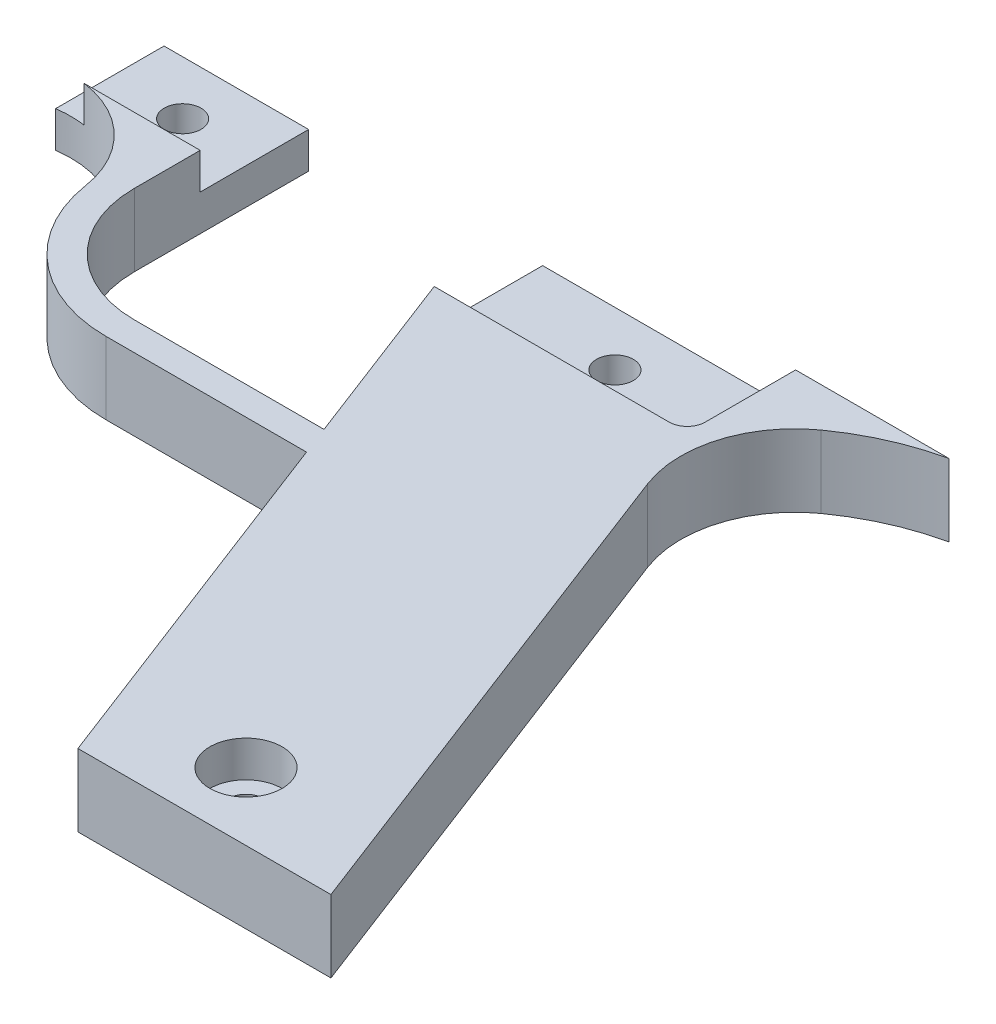
ISO-10303-21;
HEADER;
FILE_DESCRIPTION(('STEP AP214'),'2;1');
FILE_NAME('part.step','',(''),(''),'','','');
FILE_SCHEMA(('AUTOMOTIVE_DESIGN { 1 0 10303 214 1 1 1 1 }'));
ENDSEC;
DATA;
#1=APPLICATION_CONTEXT('core data for automotive mechanical design processes');
#2=APPLICATION_PROTOCOL_DEFINITION('international standard','automotive_design',2000,#1);
#3=PRODUCT_CONTEXT('',#1,'mechanical');
#4=PRODUCT('Part','Part','',(#3));
#5=PRODUCT_RELATED_PRODUCT_CATEGORY('part','',(#4));
#6=PRODUCT_DEFINITION_FORMATION('','',#4);
#7=PRODUCT_DEFINITION_CONTEXT('part definition',#1,'design');
#8=PRODUCT_DEFINITION('design','',#6,#7);
#9=PRODUCT_DEFINITION_SHAPE('','',#8);
#10=(LENGTH_UNIT() NAMED_UNIT(*) SI_UNIT(.MILLI.,.METRE.));
#11=(NAMED_UNIT(*) PLANE_ANGLE_UNIT() SI_UNIT($,.RADIAN.));
#12=(NAMED_UNIT(*) SI_UNIT($,.STERADIAN.) SOLID_ANGLE_UNIT());
#13=UNCERTAINTY_MEASURE_WITH_UNIT(LENGTH_MEASURE(1.E-05),#10,'distance_accuracy_value','');
#14=(GEOMETRIC_REPRESENTATION_CONTEXT(3) GLOBAL_UNCERTAINTY_ASSIGNED_CONTEXT((#13)) GLOBAL_UNIT_ASSIGNED_CONTEXT((#10,
#11,#12)) REPRESENTATION_CONTEXT('',''));
#15=CARTESIAN_POINT('',(0.,0.,0.));
#16=DIRECTION('',(0.,0.,1.));
#17=DIRECTION('',(1.,0.,0.));
#18=AXIS2_PLACEMENT_3D('',#15,#16,#17);
#19=CARTESIAN_POINT('',(-80.2755859595979,12.7,-120.806499719987));
#20=DIRECTION('',(0.,0.,1.));
#21=DIRECTION('',(1.,0.,0.));
#22=AXIS2_PLACEMENT_3D('',#19,#20,#21);
#23=PLANE('',#22);
#24=DIRECTION('',(-1.,0.,0.));
#25=VECTOR('',#24,1.);
#26=CARTESIAN_POINT('',(-80.2755859595979,6.35,-120.806499719987));
#27=LINE('',#26,#25);
#28=CARTESIAN_POINT('',(-80.2755859595979,6.35,-120.806499719987));
#29=VERTEX_POINT('',#28);
#30=CARTESIAN_POINT('',(-105.675585959598,6.35,-120.806499719987));
#31=VERTEX_POINT('',#30);
#32=EDGE_CURVE('E187',#29,#31,#27,.T.);
#33=ORIENTED_EDGE('',*,*,#32,.F.);
#34=DIRECTION('',(0.,-1.,0.));
#35=VECTOR('',#34,1.);
#36=CARTESIAN_POINT('',(-80.2755859595979,12.7,-120.806499719987));
#37=LINE('',#36,#35);
#38=CARTESIAN_POINT('',(-80.2755859595979,0.,-120.806499719987));
#39=VERTEX_POINT('',#38);
#40=EDGE_CURVE('E209',#29,#39,#37,.T.);
#41=ORIENTED_EDGE('',*,*,#40,.T.);
#42=DIRECTION('',(-1.,0.,0.));
#43=VECTOR('',#42,1.);
#44=CARTESIAN_POINT('',(-80.2755859595979,0.,-120.806499719987));
#45=LINE('',#44,#43);
#46=CARTESIAN_POINT('',(-105.675585959598,0.,-120.806499719987));
#47=VERTEX_POINT('',#46);
#48=EDGE_CURVE('E393',#39,#47,#45,.T.);
#49=ORIENTED_EDGE('',*,*,#48,.T.);
#50=DIRECTION('',(0.,-1.,0.));
#51=VECTOR('',#50,1.);
#52=CARTESIAN_POINT('',(-105.675585959598,12.7,-120.806499719987));
#53=LINE('',#52,#51);
#54=EDGE_CURVE('E206',#31,#47,#53,.T.);
#55=ORIENTED_EDGE('',*,*,#54,.F.);
#56=EDGE_LOOP('',(#33,#41,#49,#55));
#57=FACE_BOUND('',#56,.T.);
#58=ADVANCED_FACE('F33',(#57),#23,.F.);
#59=CARTESIAN_POINT('',(-105.675585959598,12.7,-120.806499719987));
#60=DIRECTION('',(1.,0.,0.));
#61=DIRECTION('',(0.,0.,-1.));
#62=AXIS2_PLACEMENT_3D('',#59,#60,#61);
#63=PLANE('',#62);
#64=DIRECTION('',(0.,0.,1.));
#65=VECTOR('',#64,1.);
#66=CARTESIAN_POINT('',(-105.675585959598,6.35,-120.806499719987));
#67=LINE('',#66,#65);
#68=CARTESIAN_POINT('',(-105.675585959598,6.35,-101.756499719987));
#69=VERTEX_POINT('',#68);
#70=EDGE_CURVE('E182',#31,#69,#67,.T.);
#71=ORIENTED_EDGE('',*,*,#70,.F.);
#72=ORIENTED_EDGE('',*,*,#54,.T.);
#73=DIRECTION('',(0.,0.,1.));
#74=VECTOR('',#73,1.);
#75=CARTESIAN_POINT('',(-105.675585959598,0.,-120.806499719987));
#76=LINE('',#75,#74);
#77=CARTESIAN_POINT('',(-105.675585959598,0.,-101.756499719987));
#78=VERTEX_POINT('',#77);
#79=EDGE_CURVE('E204',#47,#78,#76,.T.);
#80=ORIENTED_EDGE('',*,*,#79,.T.);
#81=DIRECTION('',(0.,-1.,0.));
#82=VECTOR('',#81,1.);
#83=CARTESIAN_POINT('',(-105.675585959598,12.7,-101.756499719987));
#84=LINE('',#83,#82);
#85=EDGE_CURVE('E198',#69,#78,#84,.T.);
#86=ORIENTED_EDGE('',*,*,#85,.F.);
#87=EDGE_LOOP('',(#71,#72,#80,#86));
#88=FACE_BOUND('',#87,.T.);
#89=ADVANCED_FACE('F202',(#88),#63,.F.);
#90=CARTESIAN_POINT('',(-92.975585959598,12.7,-111.366660829595));
#91=DIRECTION('',(0.,-1.,0.));
#92=DIRECTION('',(0.,0.,-1.));
#93=AXIS2_PLACEMENT_3D('',#90,#91,#92);
#94=CYLINDRICAL_SURFACE('',#93,3.2385);
#95=CARTESIAN_POINT('',(-92.975585959598,0.,-111.366660829595));
#96=DIRECTION('',(0.,1.,0.));
#97=DIRECTION('',(0.,0.,1.));
#98=AXIS2_PLACEMENT_3D('',#95,#96,#97);
#99=CIRCLE('',#98,3.2385);
#100=CARTESIAN_POINT('',(-92.975585959598,0.,-108.128160829595));
#101=VERTEX_POINT('',#100);
#102=EDGE_CURVE('E396',#101,#101,#99,.T.);
#103=ORIENTED_EDGE('',*,*,#102,.F.);
#104=EDGE_LOOP('',(#103));
#105=FACE_BOUND('',#104,.T.);
#106=CARTESIAN_POINT('',(-92.975585959598,6.35,-111.366660829595));
#107=DIRECTION('',(0.,1.,0.));
#108=DIRECTION('',(0.,0.,1.));
#109=AXIS2_PLACEMENT_3D('',#106,#107,#108);
#110=CIRCLE('',#109,3.2385);
#111=CARTESIAN_POINT('',(-92.975585959598,6.35,-108.128160829595));
#112=VERTEX_POINT('',#111);
#113=EDGE_CURVE('E37',#112,#112,#110,.T.);
#114=ORIENTED_EDGE('',*,*,#113,.T.);
#115=EDGE_LOOP('',(#114));
#116=FACE_BOUND('',#115,.T.);
#117=ADVANCED_FACE('F470',(#105,#116),#94,.F.);
#118=CARTESIAN_POINT('',(0.,12.7,0.));
#119=DIRECTION('',(0.933580426497203,0.,-0.358367949545298));
#120=DIRECTION('',(-0.358367949545298,0.,-0.933580426497203));
#121=AXIS2_PLACEMENT_3D('',#118,#119,#120);
#122=PLANE('',#121);
#123=DIRECTION('',(0.,-1.,0.));
#124=VECTOR('',#123,1.);
#125=CARTESIAN_POINT('',(-26.9383580355441,12.7,-70.1768219392029));
#126=LINE('',#125,#124);
#127=CARTESIAN_POINT('',(-26.9383580355441,12.7,-70.1768219392029));
#128=VERTEX_POINT('',#127);
#129=CARTESIAN_POINT('',(-26.9383580355441,0.,-70.1768219392029));
#130=VERTEX_POINT('',#129);
#131=EDGE_CURVE('E366',#128,#130,#126,.T.);
#132=ORIENTED_EDGE('',*,*,#131,.F.);
#133=DIRECTION('',(0.358367949545298,0.,0.933580426497203));
#134=VECTOR('',#133,1.);
#135=CARTESIAN_POINT('',(0.,12.7,0.));
#136=LINE('',#135,#134);
#137=CARTESIAN_POINT('',(-39.0005859595979,12.7,-101.6));
#138=VERTEX_POINT('',#137);
#139=EDGE_CURVE('E282',#138,#128,#136,.T.);
#140=ORIENTED_EDGE('',*,*,#139,.F.);
#141=DIRECTION('',(0.,-1.,0.));
#142=VECTOR('',#141,1.);
#143=CARTESIAN_POINT('',(-39.0005859595979,12.7,-101.6));
#144=LINE('',#143,#142);
#145=CARTESIAN_POINT('',(-39.0005859595979,6.35,-101.6));
#146=VERTEX_POINT('',#145);
#147=EDGE_CURVE('E298',#138,#146,#144,.T.);
#148=ORIENTED_EDGE('',*,*,#147,.T.);
#149=CARTESIAN_POINT('',(-39.0005859595979,0.,-101.6));
#150=VERTEX_POINT('',#149);
#151=EDGE_CURVE('E297',#146,#150,#144,.T.);
#152=ORIENTED_EDGE('',*,*,#151,.T.);
#153=DIRECTION('',(0.358367949545298,0.,0.933580426497203));
#154=VECTOR('',#153,1.);
#155=CARTESIAN_POINT('',(0.,0.,0.));
#156=LINE('',#155,#154);
#157=EDGE_CURVE('E271',#150,#130,#156,.T.);
#158=ORIENTED_EDGE('',*,*,#157,.T.);
#159=EDGE_LOOP('',(#132,#140,#148,#152,#158));
#160=FACE_BOUND('',#159,.T.);
#161=ADVANCED_FACE('F363',(#160),#122,.F.);
#162=CARTESIAN_POINT('',(-39.0005859595979,6.35,-101.6));
#163=DIRECTION('',(0.,0.,1.));
#164=DIRECTION('',(1.,0.,0.));
#165=AXIS2_PLACEMENT_3D('',#162,#163,#164);
#166=PLANE('',#165);
#167=DIRECTION('',(0.,1.,0.));
#168=VECTOR('',#167,1.);
#169=CARTESIAN_POINT('',(2.27441404040207,-35.6503495291082,-101.6));
#170=LINE('',#169,#168);
#171=CARTESIAN_POINT('',(2.27441404040207,6.35,-101.6));
#172=VERTEX_POINT('',#171);
#173=CARTESIAN_POINT('',(2.27441404040207,12.7,-101.6));
#174=VERTEX_POINT('',#173);
#175=EDGE_CURVE('E217',#172,#174,#170,.T.);
#176=ORIENTED_EDGE('',*,*,#175,.F.);
#177=DIRECTION('',(1.,0.,0.));
#178=VECTOR('',#177,1.);
#179=CARTESIAN_POINT('',(-39.0005859595979,6.35,-101.6));
#180=LINE('',#179,#178);
#181=EDGE_CURVE('E248',#146,#172,#180,.T.);
#182=ORIENTED_EDGE('',*,*,#181,.F.);
#183=ORIENTED_EDGE('',*,*,#147,.F.);
#184=DIRECTION('',(1.,0.,0.));
#185=VECTOR('',#184,1.);
#186=CARTESIAN_POINT('',(-39.0005859595979,12.7,-101.6));
#187=LINE('',#186,#185);
#188=EDGE_CURVE('E249',#138,#174,#187,.T.);
#189=ORIENTED_EDGE('',*,*,#188,.T.);
#190=EDGE_LOOP('',(#176,#182,#183,#189));
#191=FACE_BOUND('',#190,.T.);
#192=ADVANCED_FACE('F358',(#191),#166,.F.);
#193=CARTESIAN_POINT('',(0.,6.35,0.));
#194=DIRECTION('',(0.,1.,0.));
#195=DIRECTION('',(0.,0.,1.));
#196=AXIS2_PLACEMENT_3D('',#193,#194,#195);
#197=PLANE('',#196);
#198=CARTESIAN_POINT('',(-16.775585959598,6.35,-111.125));
#199=DIRECTION('',(0.,1.,0.));
#200=DIRECTION('',(0.,0.,1.));
#201=AXIS2_PLACEMENT_3D('',#198,#199,#200);
#202=CIRCLE('',#201,3.2385);
#203=CARTESIAN_POINT('',(-16.775585959598,6.35,-107.8865));
#204=VERTEX_POINT('',#203);
#205=EDGE_CURVE('E257',#204,#204,#202,.T.);
#206=ORIENTED_EDGE('',*,*,#205,.F.);
#207=EDGE_LOOP('',(#206));
#208=FACE_BOUND('',#207,.T.);
#209=ORIENTED_EDGE('',*,*,#181,.T.);
#210=CARTESIAN_POINT('',(2.27441404040207,6.35,-104.775));
#211=DIRECTION('',(0.,1.,0.));
#212=DIRECTION('',(0.,0.,1.));
#213=AXIS2_PLACEMENT_3D('',#210,#211,#212);
#214=CIRCLE('',#213,3.17500000000001);
#215=CARTESIAN_POINT('',(5.44941404040207,6.35,-104.775));
#216=VERTEX_POINT('',#215);
#217=EDGE_CURVE('E306',#172,#216,#214,.T.);
#218=ORIENTED_EDGE('',*,*,#217,.T.);
#219=DIRECTION('',(0.,0.,-1.));
#220=VECTOR('',#219,1.);
#221=CARTESIAN_POINT('',(5.44941404040207,6.35,-101.6));
#222=LINE('',#221,#220);
#223=CARTESIAN_POINT('',(5.44941404040207,6.35,-120.65));
#224=VERTEX_POINT('',#223);
#225=EDGE_CURVE('E252',#216,#224,#222,.T.);
#226=ORIENTED_EDGE('',*,*,#225,.T.);
#227=DIRECTION('',(-1.,0.,0.));
#228=VECTOR('',#227,1.);
#229=CARTESIAN_POINT('',(5.44941404040207,6.35,-120.65));
#230=LINE('',#229,#228);
#231=CARTESIAN_POINT('',(-39.000585959598,6.35,-120.65));
#232=VERTEX_POINT('',#231);
#233=EDGE_CURVE('E255',#224,#232,#230,.T.);
#234=ORIENTED_EDGE('',*,*,#233,.T.);
#235=DIRECTION('',(0.,0.,1.));
#236=VECTOR('',#235,1.);
#237=CARTESIAN_POINT('',(-39.000585959598,6.35,-120.65));
#238=LINE('',#237,#236);
#239=EDGE_CURVE('E246',#232,#146,#238,.T.);
#240=ORIENTED_EDGE('',*,*,#239,.T.);
#241=EDGE_LOOP('',(#209,#218,#226,#234,#240));
#242=FACE_BOUND('',#241,.T.);
#243=ADVANCED_FACE('F488',(#208,#242),#197,.T.);
#244=CARTESIAN_POINT('',(17.6737270407747,12.7,-11.8564714165145));
#245=DIRECTION('',(0.,-1.,0.));
#246=DIRECTION('',(0.,0.,-1.));
#247=AXIS2_PLACEMENT_3D('',#244,#245,#246);
#248=CYLINDRICAL_SURFACE('',#247,3.2385);
#249=CARTESIAN_POINT('',(17.6737270407747,0.,-11.8564714165145));
#250=DIRECTION('',(0.,1.,0.));
#251=DIRECTION('',(0.,0.,1.));
#252=AXIS2_PLACEMENT_3D('',#249,#250,#251);
#253=CIRCLE('',#252,3.2385);
#254=CARTESIAN_POINT('',(17.6737270407747,0.,-8.61797141651447));
#255=VERTEX_POINT('',#254);
#256=EDGE_CURVE('E263',#255,#255,#253,.T.);
#257=ORIENTED_EDGE('',*,*,#256,.F.);
#258=EDGE_LOOP('',(#257));
#259=FACE_BOUND('',#258,.T.);
#260=CARTESIAN_POINT('',(17.6737270407747,6.35,-11.8564714165145));
#261=DIRECTION('',(0.,1.,0.));
#262=DIRECTION('',(0.,0.,1.));
#263=AXIS2_PLACEMENT_3D('',#260,#261,#262);
#264=CIRCLE('',#263,3.2385);
#265=CARTESIAN_POINT('',(17.6737270407747,6.35,-8.61797141651447));
#266=VERTEX_POINT('',#265);
#267=EDGE_CURVE('E243',#266,#266,#264,.T.);
#268=ORIENTED_EDGE('',*,*,#267,.T.);
#269=EDGE_LOOP('',(#268));
#270=FACE_BOUND('',#269,.T.);
#271=ADVANCED_FACE('F491',(#259,#270),#248,.F.);
#272=CARTESIAN_POINT('',(-39.000585959598,12.7,-120.65));
#273=DIRECTION('',(0.,0.,1.));
#274=DIRECTION('',(1.,0.,0.));
#275=AXIS2_PLACEMENT_3D('',#272,#273,#274);
#276=PLANE('',#275);
#277=ORIENTED_EDGE('',*,*,#233,.F.);
#278=DIRECTION('',(0.,1.,0.));
#279=VECTOR('',#278,1.);
#280=CARTESIAN_POINT('',(5.44941404040207,-35.6503495291082,-120.65));
#281=LINE('',#280,#279);
#282=CARTESIAN_POINT('',(5.44941404040207,12.7,-120.65));
#283=VERTEX_POINT('',#282);
#284=EDGE_CURVE('E227',#224,#283,#281,.T.);
#285=ORIENTED_EDGE('',*,*,#284,.T.);
#286=DIRECTION('',(1.,0.,0.));
#287=VECTOR('',#286,1.);
#288=CARTESIAN_POINT('',(0.,12.7,-120.65));
#289=LINE('',#288,#287);
#290=CARTESIAN_POINT('',(32.40819776478,12.7,-120.65));
#291=VERTEX_POINT('',#290);
#292=EDGE_CURVE('E223',#283,#291,#289,.T.);
#293=ORIENTED_EDGE('',*,*,#292,.T.);
#294=DIRECTION('',(0.,1.,0.));
#295=VECTOR('',#294,1.);
#296=CARTESIAN_POINT('',(32.40819776478,-35.6503495291082,-120.65));
#297=LINE('',#296,#295);
#298=CARTESIAN_POINT('',(32.40819776478,0.,-120.65));
#299=VERTEX_POINT('',#298);
#300=EDGE_CURVE('E229',#299,#291,#297,.T.);
#301=ORIENTED_EDGE('',*,*,#300,.F.);
#302=DIRECTION('',(-1.,0.,0.));
#303=VECTOR('',#302,1.);
#304=CARTESIAN_POINT('',(-39.000585959598,0.,-120.65));
#305=LINE('',#304,#303);
#306=CARTESIAN_POINT('',(-39.000585959598,0.,-120.65));
#307=VERTEX_POINT('',#306);
#308=EDGE_CURVE('E333',#299,#307,#305,.T.);
#309=ORIENTED_EDGE('',*,*,#308,.T.);
#310=DIRECTION('',(0.,-1.,0.));
#311=VECTOR('',#310,1.);
#312=CARTESIAN_POINT('',(-39.000585959598,12.7,-120.65));
#313=LINE('',#312,#311);
#314=EDGE_CURVE('E301',#232,#307,#313,.T.);
#315=ORIENTED_EDGE('',*,*,#314,.F.);
#316=EDGE_LOOP('',(#277,#285,#293,#301,#309,#315));
#317=FACE_BOUND('',#316,.T.);
#318=ADVANCED_FACE('F346',(#317),#276,.F.);
#319=CARTESIAN_POINT('',(-39.0005859595979,12.7,-101.6));
#320=DIRECTION('',(1.,0.,0.));
#321=DIRECTION('',(0.,0.,-1.));
#322=AXIS2_PLACEMENT_3D('',#319,#320,#321);
#323=PLANE('',#322);
#324=ORIENTED_EDGE('',*,*,#239,.F.);
#325=ORIENTED_EDGE('',*,*,#314,.T.);
#326=DIRECTION('',(0.,0.,1.));
#327=VECTOR('',#326,1.);
#328=CARTESIAN_POINT('',(-39.0005859595979,0.,-101.6));
#329=LINE('',#328,#327);
#330=EDGE_CURVE('E289',#307,#150,#329,.T.);
#331=ORIENTED_EDGE('',*,*,#330,.T.);
#332=ORIENTED_EDGE('',*,*,#151,.F.);
#333=EDGE_LOOP('',(#324,#325,#331,#332));
#334=FACE_BOUND('',#333,.T.);
#335=ADVANCED_FACE('F498',(#334),#323,.F.);
#336=CARTESIAN_POINT('',(-16.775585959598,12.7,-111.125));
#337=DIRECTION('',(0.,-1.,0.));
#338=DIRECTION('',(0.,0.,-1.));
#339=AXIS2_PLACEMENT_3D('',#336,#337,#338);
#340=CYLINDRICAL_SURFACE('',#339,3.2385);
#341=CARTESIAN_POINT('',(-16.775585959598,0.,-111.125));
#342=DIRECTION('',(0.,1.,0.));
#343=DIRECTION('',(0.,0.,1.));
#344=AXIS2_PLACEMENT_3D('',#341,#342,#343);
#345=CIRCLE('',#344,3.2385);
#346=CARTESIAN_POINT('',(-16.775585959598,0.,-107.8865));
#347=VERTEX_POINT('',#346);
#348=EDGE_CURVE('E260',#347,#347,#345,.T.);
#349=ORIENTED_EDGE('',*,*,#348,.F.);
#350=EDGE_LOOP('',(#349));
#351=FACE_BOUND('',#350,.T.);
#352=ORIENTED_EDGE('',*,*,#205,.T.);
#353=EDGE_LOOP('',(#352));
#354=FACE_BOUND('',#353,.T.);
#355=ADVANCED_FACE('F495',(#351,#354),#340,.F.);
#356=CARTESIAN_POINT('',(0.,12.7,0.));
#357=DIRECTION('',(0.,-1.,0.));
#358=DIRECTION('',(0.,0.,-1.));
#359=AXIS2_PLACEMENT_3D('',#356,#357,#358);
#360=PLANE('',#359);
#361=CARTESIAN_POINT('',(17.6737270407747,12.7,-11.8564714165145));
#362=DIRECTION('',(0.,1.,0.));
#363=DIRECTION('',(0.,0.,1.));
#364=AXIS2_PLACEMENT_3D('',#361,#362,#363);
#365=CIRCLE('',#364,6.35);
#366=CARTESIAN_POINT('',(17.6737270407747,12.7,-5.50647141651448));
#367=VERTEX_POINT('',#366);
#368=EDGE_CURVE('E221',#367,#367,#365,.T.);
#369=ORIENTED_EDGE('',*,*,#368,.F.);
#370=EDGE_LOOP('',(#369));
#371=FACE_BOUND('',#370,.T.);
#372=DIRECTION('',(0.,0.,-1.));
#373=VECTOR('',#372,1.);
#374=CARTESIAN_POINT('',(-80.2755859595979,12.7,-120.806499719987));
#375=LINE('',#374,#373);
#376=CARTESIAN_POINT('',(-80.2755859595979,12.7,-90.1768219392029));
#377=VERTEX_POINT('',#376);
#378=CARTESIAN_POINT('',(-80.2755859595979,12.7,-101.756499719987));
#379=VERTEX_POINT('',#378);
#380=EDGE_CURVE('E406',#377,#379,#375,.T.);
#381=ORIENTED_EDGE('',*,*,#380,.T.);
#382=DIRECTION('',(1.,0.,0.));
#383=VECTOR('',#382,1.);
#384=CARTESIAN_POINT('',(-105.675585959598,12.7,-101.756499719987));
#385=LINE('',#384,#383);
#386=CARTESIAN_POINT('',(-100.677876833899,12.7,-101.756499719987));
#387=VERTEX_POINT('',#386);
#388=EDGE_CURVE('E192',#387,#379,#385,.T.);
#389=ORIENTED_EDGE('',*,*,#388,.F.);
#390=CARTESIAN_POINT('',(-103.176731396749,12.7,-83.510892962066));
#391=DIRECTION('',(0.,-1.,0.));
#392=DIRECTION('',(0.,0.,-1.));
#393=AXIS2_PLACEMENT_3D('',#390,#391,#392);
#394=CIRCLE('',#393,18.4159289771369);
#395=CARTESIAN_POINT('',(-84.9791604585697,12.7,-86.3384099011654));
#396=VERTEX_POINT('',#395);
#397=EDGE_CURVE('E424',#387,#396,#394,.T.);
#398=ORIENTED_EDGE('',*,*,#397,.T.);
#399=CARTESIAN_POINT('',(-60.2755859595979,12.7,-90.1768219392029));
#400=DIRECTION('',(0.,1.,0.));
#401=DIRECTION('',(0.,0.,-1.));
#402=AXIS2_PLACEMENT_3D('',#399,#400,#401);
#403=CIRCLE('',#402,25.);
#404=CARTESIAN_POINT('',(-60.2755859595979,12.7,-65.1768219392029));
#405=VERTEX_POINT('',#404);
#406=EDGE_CURVE('E391',#396,#405,#403,.T.);
#407=ORIENTED_EDGE('',*,*,#406,.T.);
#408=DIRECTION('',(1.,0.,0.));
#409=VECTOR('',#408,1.);
#410=CARTESIAN_POINT('',(-60.2755859595979,12.7,-65.1768219392029));
#411=LINE('',#410,#409);
#412=CARTESIAN_POINT('',(-25.019037860367,12.7,-65.1768219392029));
#413=VERTEX_POINT('',#412);
#414=EDGE_CURVE('E374',#405,#413,#411,.T.);
#415=ORIENTED_EDGE('',*,*,#414,.T.);
#416=CARTESIAN_POINT('',(0.,12.7,0.));
#417=VERTEX_POINT('',#416);
#418=EDGE_CURVE('E274',#413,#417,#136,.T.);
#419=ORIENTED_EDGE('',*,*,#418,.T.);
#420=DIRECTION('',(1.,0.,0.));
#421=VECTOR('',#420,1.);
#422=CARTESIAN_POINT('',(44.45,12.7,0.));
#423=LINE('',#422,#421);
#424=CARTESIAN_POINT('',(44.45,12.7,0.));
#425=VERTEX_POINT('',#424);
#426=EDGE_CURVE('E267',#417,#425,#423,.T.);
#427=ORIENTED_EDGE('',*,*,#426,.T.);
#428=DIRECTION('',(-0.358367949545298,0.,-0.933580426497203));
#429=VECTOR('',#428,1.);
#430=CARTESIAN_POINT('',(5.44941404040207,12.7,-101.6));
#431=LINE('',#430,#429);
#432=CARTESIAN_POINT('',(9.78389870967169,12.7,-90.3082813870027));
#433=VERTEX_POINT('',#432);
#434=EDGE_CURVE('E270',#425,#433,#431,.T.);
#435=ORIENTED_EDGE('',*,*,#434,.T.);
#436=CARTESIAN_POINT('',(28.4555072396157,12.7,-97.4756403779086));
#437=DIRECTION('',(0.,-1.,0.));
#438=DIRECTION('',(0.,0.,-1.));
#439=AXIS2_PLACEMENT_3D('',#436,#437,#438);
#440=CIRCLE('',#439,20.);
#441=CARTESIAN_POINT('',(16.8428457179652,12.7,-113.758947547632));
#442=VERTEX_POINT('',#441);
#443=EDGE_CURVE('E11',#433,#442,#440,.T.);
#444=ORIENTED_EDGE('',*,*,#443,.T.);
#445=CARTESIAN_POINT('',(41.3881264077596,12.7,-79.3414848243924));
#446=DIRECTION('',(0.,1.,0.));
#447=DIRECTION('',(0.,0.,1.));
#448=AXIS2_PLACEMENT_3D('',#445,#446,#447);
#449=CIRCLE('',#448,42.2733077064761);
#450=EDGE_CURVE('E222',#442,#291,#449,.F.);
#451=ORIENTED_EDGE('',*,*,#450,.T.);
#452=ORIENTED_EDGE('',*,*,#292,.F.);
#453=DIRECTION('',(0.,0.,1.));
#454=VECTOR('',#453,1.);
#455=CARTESIAN_POINT('',(5.44941404040208,12.7,0.));
#456=LINE('',#455,#454);
#457=CARTESIAN_POINT('',(5.44941404040207,12.7,-104.775));
#458=VERTEX_POINT('',#457);
#459=EDGE_CURVE('E218',#283,#458,#456,.T.);
#460=ORIENTED_EDGE('',*,*,#459,.T.);
#461=CARTESIAN_POINT('',(2.27441404040207,12.7,-104.775));
#462=DIRECTION('',(0.,1.,0.));
#463=DIRECTION('',(0.,0.,1.));
#464=AXIS2_PLACEMENT_3D('',#461,#462,#463);
#465=CIRCLE('',#464,3.17500000000001);
#466=EDGE_CURVE('E230',#174,#458,#465,.T.);
#467=ORIENTED_EDGE('',*,*,#466,.F.);
#468=ORIENTED_EDGE('',*,*,#188,.F.);
#469=ORIENTED_EDGE('',*,*,#139,.T.);
#470=DIRECTION('',(-1.,0.,0.));
#471=VECTOR('',#470,1.);
#472=CARTESIAN_POINT('',(-60.2755859595979,12.7,-70.1768219392029));
#473=LINE('',#472,#471);
#474=CARTESIAN_POINT('',(-60.2755859595979,12.7,-70.1768219392029));
#475=VERTEX_POINT('',#474);
#476=EDGE_CURVE('E368',#128,#475,#473,.T.);
#477=ORIENTED_EDGE('',*,*,#476,.T.);
#478=CARTESIAN_POINT('',(-60.2755859595979,12.7,-90.1768219392029));
#479=DIRECTION('',(0.,-1.,0.));
#480=DIRECTION('',(0.,0.,-1.));
#481=AXIS2_PLACEMENT_3D('',#478,#479,#480);
#482=CIRCLE('',#481,20.);
#483=EDGE_CURVE('E371',#475,#377,#482,.T.);
#484=ORIENTED_EDGE('',*,*,#483,.T.);
#485=EDGE_LOOP('',(#381,#389,#398,#407,#415,#419,#427,#435,#444,#451,#452,#460,#467,#468,#469,
#477,#484));
#486=FACE_BOUND('',#485,.T.);
#487=ADVANCED_FACE('F338',(#371,#486),#360,.F.);
#488=CARTESIAN_POINT('',(0.,0.,0.));
#489=DIRECTION('',(0.,-1.,0.));
#490=DIRECTION('',(0.,0.,-1.));
#491=AXIS2_PLACEMENT_3D('',#488,#489,#490);
#492=PLANE('',#491);
#493=CARTESIAN_POINT('',(41.3881264077596,0.,-79.3414848243924));
#494=DIRECTION('',(0.,-1.,0.));
#495=DIRECTION('',(0.,0.,-1.));
#496=AXIS2_PLACEMENT_3D('',#493,#494,#495);
#497=CIRCLE('',#496,42.2733077064761);
#498=CARTESIAN_POINT('',(16.8428457179652,0.,-113.758947547632));
#499=VERTEX_POINT('',#498);
#500=EDGE_CURVE('E226',#499,#299,#497,.T.);
#501=ORIENTED_EDGE('',*,*,#500,.F.);
#502=CARTESIAN_POINT('',(28.4555072396157,0.,-97.4756403779086));
#503=DIRECTION('',(0.,-1.,0.));
#504=DIRECTION('',(0.,0.,-1.));
#505=AXIS2_PLACEMENT_3D('',#502,#503,#504);
#506=CIRCLE('',#505,20.);
#507=CARTESIAN_POINT('',(9.78389870967169,0.,-90.3082813870027));
#508=VERTEX_POINT('',#507);
#509=EDGE_CURVE('E42',#499,#508,#506,.F.);
#510=ORIENTED_EDGE('',*,*,#509,.T.);
#511=DIRECTION('',(-0.358367949545298,0.,-0.933580426497203));
#512=VECTOR('',#511,1.);
#513=CARTESIAN_POINT('',(5.44941404040207,0.,-101.6));
#514=LINE('',#513,#512);
#515=CARTESIAN_POINT('',(44.45,0.,0.));
#516=VERTEX_POINT('',#515);
#517=EDGE_CURVE('E324',#516,#508,#514,.T.);
#518=ORIENTED_EDGE('',*,*,#517,.F.);
#519=DIRECTION('',(1.,0.,0.));
#520=VECTOR('',#519,1.);
#521=CARTESIAN_POINT('',(44.45,0.,0.));
#522=LINE('',#521,#520);
#523=CARTESIAN_POINT('',(0.,0.,0.));
#524=VERTEX_POINT('',#523);
#525=EDGE_CURVE('E266',#524,#516,#522,.T.);
#526=ORIENTED_EDGE('',*,*,#525,.F.);
#527=CARTESIAN_POINT('',(-25.019037860367,0.,-65.1768219392029));
#528=VERTEX_POINT('',#527);
#529=EDGE_CURVE('E286',#528,#524,#156,.T.);
#530=ORIENTED_EDGE('',*,*,#529,.F.);
#531=DIRECTION('',(1.,0.,0.));
#532=VECTOR('',#531,1.);
#533=CARTESIAN_POINT('',(-60.2755859595979,0.,-65.1768219392029));
#534=LINE('',#533,#532);
#535=CARTESIAN_POINT('',(-60.2755859595979,0.,-65.1768219392029));
#536=VERTEX_POINT('',#535);
#537=EDGE_CURVE('E58',#536,#528,#534,.T.);
#538=ORIENTED_EDGE('',*,*,#537,.F.);
#539=CARTESIAN_POINT('',(-60.2755859595979,0.,-90.1768219392029));
#540=DIRECTION('',(0.,1.,0.));
#541=DIRECTION('',(0.,0.,-1.));
#542=AXIS2_PLACEMENT_3D('',#539,#540,#541);
#543=CIRCLE('',#542,25.);
#544=CARTESIAN_POINT('',(-84.9791604585697,0.,-86.3384099011654));
#545=VERTEX_POINT('',#544);
#546=EDGE_CURVE('E400',#545,#536,#543,.T.);
#547=ORIENTED_EDGE('',*,*,#546,.F.);
#548=CARTESIAN_POINT('',(-103.176731396749,0.,-83.510892962066));
#549=DIRECTION('',(0.,-1.,0.));
#550=DIRECTION('',(0.,0.,-1.));
#551=AXIS2_PLACEMENT_3D('',#548,#549,#550);
#552=CIRCLE('',#551,18.4159289771369);
#553=EDGE_CURVE('E398',#78,#545,#552,.T.);
#554=ORIENTED_EDGE('',*,*,#553,.F.);
#555=ORIENTED_EDGE('',*,*,#79,.F.);
#556=ORIENTED_EDGE('',*,*,#48,.F.);
#557=DIRECTION('',(0.,0.,-1.));
#558=VECTOR('',#557,1.);
#559=CARTESIAN_POINT('',(-80.2755859595979,0.,-101.926821939203));
#560=LINE('',#559,#558);
#561=CARTESIAN_POINT('',(-80.2755859595979,0.,-90.1768219392029));
#562=VERTEX_POINT('',#561);
#563=EDGE_CURVE('E404',#562,#39,#560,.T.);
#564=ORIENTED_EDGE('',*,*,#563,.F.);
#565=CARTESIAN_POINT('',(-60.2755859595979,0.,-90.1768219392029));
#566=DIRECTION('',(0.,-1.,0.));
#567=DIRECTION('',(0.,0.,-1.));
#568=AXIS2_PLACEMENT_3D('',#565,#566,#567);
#569=CIRCLE('',#568,20.);
#570=CARTESIAN_POINT('',(-60.2755859595979,0.,-70.1768219392029));
#571=VERTEX_POINT('',#570);
#572=EDGE_CURVE('E402',#571,#562,#569,.T.);
#573=ORIENTED_EDGE('',*,*,#572,.F.);
#574=DIRECTION('',(-1.,0.,0.));
#575=VECTOR('',#574,1.);
#576=CARTESIAN_POINT('',(-60.2755859595979,0.,-70.1768219392029));
#577=LINE('',#576,#575);
#578=EDGE_CURVE('E380',#130,#571,#577,.T.);
#579=ORIENTED_EDGE('',*,*,#578,.F.);
#580=ORIENTED_EDGE('',*,*,#157,.F.);
#581=ORIENTED_EDGE('',*,*,#330,.F.);
#582=ORIENTED_EDGE('',*,*,#308,.F.);
#583=EDGE_LOOP('',(#501,#510,#518,#526,#530,#538,#547,#554,#555,#556,#564,#573,#579,#580,#581,#582));
#584=FACE_BOUND('',#583,.T.);
#585=ORIENTED_EDGE('',*,*,#348,.T.);
#586=EDGE_LOOP('',(#585));
#587=FACE_BOUND('',#586,.T.);
#588=ORIENTED_EDGE('',*,*,#256,.T.);
#589=EDGE_LOOP('',(#588));
#590=FACE_BOUND('',#589,.T.);
#591=ORIENTED_EDGE('',*,*,#102,.T.);
#592=EDGE_LOOP('',(#591));
#593=FACE_BOUND('',#592,.T.);
#594=ADVANCED_FACE('F321',(#584,#587,#590,#593),#492,.T.);
#595=CARTESIAN_POINT('',(44.45,12.7,0.));
#596=DIRECTION('',(0.,0.,-1.));
#597=DIRECTION('',(-1.,0.,0.));
#598=AXIS2_PLACEMENT_3D('',#595,#596,#597);
#599=PLANE('',#598);
#600=ORIENTED_EDGE('',*,*,#525,.T.);
#601=DIRECTION('',(0.,-1.,0.));
#602=VECTOR('',#601,1.);
#603=CARTESIAN_POINT('',(44.45,12.7,0.));
#604=LINE('',#603,#602);
#605=EDGE_CURVE('E303',#425,#516,#604,.T.);
#606=ORIENTED_EDGE('',*,*,#605,.F.);
#607=ORIENTED_EDGE('',*,*,#426,.F.);
#608=DIRECTION('',(0.,-1.,0.));
#609=VECTOR('',#608,1.);
#610=CARTESIAN_POINT('',(0.,12.7,0.));
#611=LINE('',#610,#609);
#612=EDGE_CURVE('E285',#417,#524,#611,.T.);
#613=ORIENTED_EDGE('',*,*,#612,.T.);
#614=EDGE_LOOP('',(#600,#606,#607,#613));
#615=FACE_BOUND('',#614,.T.);
#616=ADVANCED_FACE('F457',(#615),#599,.F.);
#617=CARTESIAN_POINT('',(5.44941404040207,12.7,-101.6));
#618=DIRECTION('',(-0.933580426497203,0.,0.358367949545298));
#619=DIRECTION('',(0.358367949545298,0.,0.933580426497203));
#620=AXIS2_PLACEMENT_3D('',#617,#618,#619);
#621=PLANE('',#620);
#622=ORIENTED_EDGE('',*,*,#517,.T.);
#623=DIRECTION('',(0.,1.,0.));
#624=VECTOR('',#623,1.);
#625=CARTESIAN_POINT('',(9.78389870967169,12.7,-90.3082813870027));
#626=LINE('',#625,#624);
#627=EDGE_CURVE('E316',#508,#433,#626,.T.);
#628=ORIENTED_EDGE('',*,*,#627,.T.);
#629=ORIENTED_EDGE('',*,*,#434,.F.);
#630=ORIENTED_EDGE('',*,*,#605,.T.);
#631=EDGE_LOOP('',(#622,#628,#629,#630));
#632=FACE_BOUND('',#631,.T.);
#633=ADVANCED_FACE('F330',(#632),#621,.F.);
#634=ORIENTED_EDGE('',*,*,#418,.F.);
#635=DIRECTION('',(0.,-1.,0.));
#636=VECTOR('',#635,1.);
#637=CARTESIAN_POINT('',(-25.019037860367,12.7,-65.1768219392029));
#638=LINE('',#637,#636);
#639=EDGE_CURVE('E413',#413,#528,#638,.T.);
#640=ORIENTED_EDGE('',*,*,#639,.T.);
#641=ORIENTED_EDGE('',*,*,#529,.T.);
#642=ORIENTED_EDGE('',*,*,#612,.F.);
#643=EDGE_LOOP('',(#634,#640,#641,#642));
#644=FACE_BOUND('',#643,.T.);
#645=ADVANCED_FACE('F454',(#644),#122,.F.);
#646=CARTESIAN_POINT('',(17.6737270407747,6.35,-11.8564714165145));
#647=DIRECTION('',(0.,1.,0.));
#648=DIRECTION('',(0.,0.,1.));
#649=AXIS2_PLACEMENT_3D('',#646,#647,#648);
#650=CYLINDRICAL_SURFACE('',#649,6.35);
#651=CARTESIAN_POINT('',(17.6737270407747,6.35,-11.8564714165145));
#652=DIRECTION('',(0.,1.,0.));
#653=DIRECTION('',(0.,0.,1.));
#654=AXIS2_PLACEMENT_3D('',#651,#652,#653);
#655=CIRCLE('',#654,6.35);
#656=CARTESIAN_POINT('',(17.6737270407747,6.35,-5.50647141651448));
#657=VERTEX_POINT('',#656);
#658=EDGE_CURVE('E240',#657,#657,#655,.T.);
#659=ORIENTED_EDGE('',*,*,#658,.F.);
#660=EDGE_LOOP('',(#659));
#661=FACE_BOUND('',#660,.T.);
#662=ORIENTED_EDGE('',*,*,#368,.T.);
#663=EDGE_LOOP('',(#662));
#664=FACE_BOUND('',#663,.T.);
#665=ADVANCED_FACE('F483',(#661,#664),#650,.F.);
#666=CARTESIAN_POINT('',(17.6737270407747,6.35,-11.8564714165145));
#667=DIRECTION('',(0.,1.,0.));
#668=DIRECTION('',(0.,0.,1.));
#669=AXIS2_PLACEMENT_3D('',#666,#667,#668);
#670=PLANE('',#669);
#671=ORIENTED_EDGE('',*,*,#267,.F.);
#672=EDGE_LOOP('',(#671));
#673=FACE_BOUND('',#672,.T.);
#674=ORIENTED_EDGE('',*,*,#658,.T.);
#675=EDGE_LOOP('',(#674));
#676=FACE_BOUND('',#675,.T.);
#677=ADVANCED_FACE('F480',(#673,#676),#670,.T.);
#678=CARTESIAN_POINT('',(2.27441404040207,-35.6503495291082,-104.775));
#679=DIRECTION('',(0.,1.,0.));
#680=DIRECTION('',(0.,0.,1.));
#681=AXIS2_PLACEMENT_3D('',#678,#679,#680);
#682=CYLINDRICAL_SURFACE('',#681,3.17500000000001);
#683=ORIENTED_EDGE('',*,*,#217,.F.);
#684=ORIENTED_EDGE('',*,*,#175,.T.);
#685=ORIENTED_EDGE('',*,*,#466,.T.);
#686=DIRECTION('',(0.,1.,0.));
#687=VECTOR('',#686,1.);
#688=CARTESIAN_POINT('',(5.44941404040207,-35.6503495291082,-104.775));
#689=LINE('',#688,#687);
#690=EDGE_CURVE('E233',#216,#458,#689,.T.);
#691=ORIENTED_EDGE('',*,*,#690,.F.);
#692=EDGE_LOOP('',(#683,#684,#685,#691));
#693=FACE_BOUND('',#692,.T.);
#694=ADVANCED_FACE('F353',(#693),#682,.F.);
#695=CARTESIAN_POINT('',(5.44941404040208,-35.6503495291082,0.));
#696=DIRECTION('',(-1.,0.,0.));
#697=DIRECTION('',(0.,0.,1.));
#698=AXIS2_PLACEMENT_3D('',#695,#696,#697);
#699=PLANE('',#698);
#700=ORIENTED_EDGE('',*,*,#284,.F.);
#701=ORIENTED_EDGE('',*,*,#225,.F.);
#702=ORIENTED_EDGE('',*,*,#690,.T.);
#703=ORIENTED_EDGE('',*,*,#459,.F.);
#704=EDGE_LOOP('',(#700,#701,#702,#703));
#705=FACE_BOUND('',#704,.T.);
#706=ADVANCED_FACE('F350',(#705),#699,.T.);
#707=CARTESIAN_POINT('',(41.3881264077596,-35.6503495291082,-79.3414848243924));
#708=DIRECTION('',(0.,1.,0.));
#709=DIRECTION('',(0.,0.,1.));
#710=AXIS2_PLACEMENT_3D('',#707,#708,#709);
#711=CYLINDRICAL_SURFACE('',#710,42.2733077064761);
#712=ORIENTED_EDGE('',*,*,#450,.F.);
#713=DIRECTION('',(0.,1.,0.));
#714=VECTOR('',#713,1.);
#715=CARTESIAN_POINT('',(16.8428457179652,-35.6503495291082,-113.758947547632));
#716=LINE('',#715,#714);
#717=EDGE_CURVE('E313',#442,#499,#716,.F.);
#718=ORIENTED_EDGE('',*,*,#717,.T.);
#719=ORIENTED_EDGE('',*,*,#500,.T.);
#720=ORIENTED_EDGE('',*,*,#300,.T.);
#721=EDGE_LOOP('',(#712,#718,#719,#720));
#722=FACE_BOUND('',#721,.T.);
#723=ADVANCED_FACE('F341',(#722),#711,.F.);
#724=CARTESIAN_POINT('',(28.4555072396157,-35.6503495291082,-97.4756403779086));
#725=DIRECTION('',(0.,1.,0.));
#726=DIRECTION('',(0.,0.,1.));
#727=AXIS2_PLACEMENT_3D('',#724,#725,#726);
#728=CYLINDRICAL_SURFACE('',#727,20.);
#729=ORIENTED_EDGE('',*,*,#443,.F.);
#730=ORIENTED_EDGE('',*,*,#627,.F.);
#731=ORIENTED_EDGE('',*,*,#509,.F.);
#732=ORIENTED_EDGE('',*,*,#717,.F.);
#733=EDGE_LOOP('',(#729,#730,#731,#732));
#734=FACE_BOUND('',#733,.T.);
#735=ADVANCED_FACE('F35',(#734),#728,.F.);
#736=CARTESIAN_POINT('',(-103.176731396749,12.7,-83.510892962066));
#737=DIRECTION('',(0.,-1.,0.));
#738=DIRECTION('',(0.,0.,-1.));
#739=AXIS2_PLACEMENT_3D('',#736,#737,#738);
#740=CYLINDRICAL_SURFACE('',#739,18.4159289771369);
#741=ORIENTED_EDGE('',*,*,#397,.F.);
#742=DIRECTION('',(0.,-1.,0.));
#743=VECTOR('',#742,1.);
#744=CARTESIAN_POINT('',(-100.677876833899,12.7,-101.756499719987));
#745=LINE('',#744,#743);
#746=CARTESIAN_POINT('',(-100.677876833899,6.35,-101.756499719987));
#747=VERTEX_POINT('',#746);
#748=EDGE_CURVE('E200',#387,#747,#745,.T.);
#749=ORIENTED_EDGE('',*,*,#748,.T.);
#750=CARTESIAN_POINT('',(-103.176731396749,6.35,-83.510892962066));
#751=DIRECTION('',(0.,1.,0.));
#752=DIRECTION('',(0.,0.,1.));
#753=AXIS2_PLACEMENT_3D('',#750,#751,#752);
#754=CIRCLE('',#753,18.4159289771369);
#755=EDGE_CURVE('E185',#69,#747,#754,.F.);
#756=ORIENTED_EDGE('',*,*,#755,.F.);
#757=ORIENTED_EDGE('',*,*,#85,.T.);
#758=ORIENTED_EDGE('',*,*,#553,.T.);
#759=DIRECTION('',(0.,-1.,0.));
#760=VECTOR('',#759,1.);
#761=CARTESIAN_POINT('',(-84.9791604585697,12.7,-86.3384099011654));
#762=LINE('',#761,#760);
#763=EDGE_CURVE('E207',#396,#545,#762,.T.);
#764=ORIENTED_EDGE('',*,*,#763,.F.);
#765=EDGE_LOOP('',(#741,#749,#756,#757,#758,#764));
#766=FACE_BOUND('',#765,.T.);
#767=ADVANCED_FACE('F197',(#766),#740,.F.);
#768=CARTESIAN_POINT('',(-60.2755859595979,12.7,-90.1768219392029));
#769=DIRECTION('',(0.,-1.,0.));
#770=DIRECTION('',(0.,0.,-1.));
#771=AXIS2_PLACEMENT_3D('',#768,#769,#770);
#772=CYLINDRICAL_SURFACE('',#771,25.);
#773=ORIENTED_EDGE('',*,*,#546,.T.);
#774=DIRECTION('',(0.,-1.,0.));
#775=VECTOR('',#774,1.);
#776=CARTESIAN_POINT('',(-60.2755859595979,12.7,-65.1768219392029));
#777=LINE('',#776,#775);
#778=EDGE_CURVE('E212',#405,#536,#777,.T.);
#779=ORIENTED_EDGE('',*,*,#778,.F.);
#780=ORIENTED_EDGE('',*,*,#406,.F.);
#781=ORIENTED_EDGE('',*,*,#763,.T.);
#782=EDGE_LOOP('',(#773,#779,#780,#781));
#783=FACE_BOUND('',#782,.T.);
#784=ADVANCED_FACE('F448',(#783),#772,.T.);
#785=CARTESIAN_POINT('',(-60.2755859595979,12.7,-65.1768219392029));
#786=DIRECTION('',(0.,0.,-1.));
#787=DIRECTION('',(-1.,0.,0.));
#788=AXIS2_PLACEMENT_3D('',#785,#786,#787);
#789=PLANE('',#788);
#790=ORIENTED_EDGE('',*,*,#537,.T.);
#791=ORIENTED_EDGE('',*,*,#639,.F.);
#792=ORIENTED_EDGE('',*,*,#414,.F.);
#793=ORIENTED_EDGE('',*,*,#778,.T.);
#794=EDGE_LOOP('',(#790,#791,#792,#793));
#795=FACE_BOUND('',#794,.T.);
#796=ADVANCED_FACE('F449',(#795),#789,.F.);
#797=CARTESIAN_POINT('',(-60.2755859595979,12.7,-70.1768219392029));
#798=DIRECTION('',(0.,0.,1.));
#799=DIRECTION('',(1.,0.,0.));
#800=AXIS2_PLACEMENT_3D('',#797,#798,#799);
#801=PLANE('',#800);
#802=ORIENTED_EDGE('',*,*,#578,.T.);
#803=DIRECTION('',(0.,-1.,0.));
#804=VECTOR('',#803,1.);
#805=CARTESIAN_POINT('',(-60.2755859595979,12.7,-70.1768219392029));
#806=LINE('',#805,#804);
#807=EDGE_CURVE('E377',#475,#571,#806,.T.);
#808=ORIENTED_EDGE('',*,*,#807,.F.);
#809=ORIENTED_EDGE('',*,*,#476,.F.);
#810=ORIENTED_EDGE('',*,*,#131,.T.);
#811=EDGE_LOOP('',(#802,#808,#809,#810));
#812=FACE_BOUND('',#811,.T.);
#813=ADVANCED_FACE('F378',(#812),#801,.F.);
#814=CARTESIAN_POINT('',(-60.2755859595979,12.7,-90.1768219392029));
#815=DIRECTION('',(0.,-1.,0.));
#816=DIRECTION('',(0.,0.,-1.));
#817=AXIS2_PLACEMENT_3D('',#814,#815,#816);
#818=CYLINDRICAL_SURFACE('',#817,20.);
#819=ORIENTED_EDGE('',*,*,#572,.T.);
#820=DIRECTION('',(0.,-1.,0.));
#821=VECTOR('',#820,1.);
#822=CARTESIAN_POINT('',(-80.2755859595979,12.7,-90.1768219392029));
#823=LINE('',#822,#821);
#824=EDGE_CURVE('E383',#377,#562,#823,.T.);
#825=ORIENTED_EDGE('',*,*,#824,.F.);
#826=ORIENTED_EDGE('',*,*,#483,.F.);
#827=ORIENTED_EDGE('',*,*,#807,.T.);
#828=EDGE_LOOP('',(#819,#825,#826,#827));
#829=FACE_BOUND('',#828,.T.);
#830=ADVANCED_FACE('F385',(#829),#818,.F.);
#831=CARTESIAN_POINT('',(-80.2755859595979,12.7,-101.926821939203));
#832=DIRECTION('',(-1.,0.,0.));
#833=DIRECTION('',(0.,0.,1.));
#834=AXIS2_PLACEMENT_3D('',#831,#832,#833);
#835=PLANE('',#834);
#836=DIRECTION('',(0.,0.,-1.));
#837=VECTOR('',#836,1.);
#838=CARTESIAN_POINT('',(-80.2755859595979,6.35,-101.756499719987));
#839=LINE('',#838,#837);
#840=CARTESIAN_POINT('',(-80.2755859595979,6.35,-101.756499719987));
#841=VERTEX_POINT('',#840);
#842=EDGE_CURVE('E437',#841,#29,#839,.T.);
#843=ORIENTED_EDGE('',*,*,#842,.F.);
#844=DIRECTION('',(0.,1.,0.));
#845=VECTOR('',#844,1.);
#846=CARTESIAN_POINT('',(-80.2755859595979,6.35,-101.756499719987));
#847=LINE('',#846,#845);
#848=EDGE_CURVE('E50',#841,#379,#847,.T.);
#849=ORIENTED_EDGE('',*,*,#848,.T.);
#850=ORIENTED_EDGE('',*,*,#380,.F.);
#851=ORIENTED_EDGE('',*,*,#824,.T.);
#852=ORIENTED_EDGE('',*,*,#563,.T.);
#853=ORIENTED_EDGE('',*,*,#40,.F.);
#854=EDGE_LOOP('',(#843,#849,#850,#851,#852,#853));
#855=FACE_BOUND('',#854,.T.);
#856=ADVANCED_FACE('F442',(#855),#835,.F.);
#857=CARTESIAN_POINT('',(-105.675585959598,6.35,-101.756499719987));
#858=DIRECTION('',(0.,0.,1.));
#859=DIRECTION('',(1.,0.,0.));
#860=AXIS2_PLACEMENT_3D('',#857,#858,#859);
#861=PLANE('',#860);
#862=ORIENTED_EDGE('',*,*,#388,.T.);
#863=ORIENTED_EDGE('',*,*,#848,.F.);
#864=DIRECTION('',(1.,0.,0.));
#865=VECTOR('',#864,1.);
#866=CARTESIAN_POINT('',(-105.675585959598,6.35,-101.756499719987));
#867=LINE('',#866,#865);
#868=EDGE_CURVE('E191',#747,#841,#867,.T.);
#869=ORIENTED_EDGE('',*,*,#868,.F.);
#870=ORIENTED_EDGE('',*,*,#748,.F.);
#871=EDGE_LOOP('',(#862,#863,#869,#870));
#872=FACE_BOUND('',#871,.T.);
#873=ADVANCED_FACE('F678',(#872),#861,.F.);
#874=CARTESIAN_POINT('',(0.,6.35,0.));
#875=DIRECTION('',(0.,1.,0.));
#876=DIRECTION('',(0.,0.,1.));
#877=AXIS2_PLACEMENT_3D('',#874,#875,#876);
#878=PLANE('',#877);
#879=ORIENTED_EDGE('',*,*,#113,.F.);
#880=EDGE_LOOP('',(#879));
#881=FACE_BOUND('',#880,.T.);
#882=ORIENTED_EDGE('',*,*,#755,.T.);
#883=ORIENTED_EDGE('',*,*,#868,.T.);
#884=ORIENTED_EDGE('',*,*,#842,.T.);
#885=ORIENTED_EDGE('',*,*,#32,.T.);
#886=ORIENTED_EDGE('',*,*,#70,.T.);
#887=EDGE_LOOP('',(#882,#883,#884,#885,#886));
#888=FACE_BOUND('',#887,.T.);
#889=ADVANCED_FACE('F184',(#881,#888),#878,.T.);
#890=CLOSED_SHELL('',(#58,#89,#117,#161,#192,#243,#271,#318,#335,#355,#487,#594,#616,#633,#645,
#665,#677,#694,#706,#723,#735,#767,#784,#796,#813,#830,#856,#873,#889));
#891=MANIFOLD_SOLID_BREP('B2',#890);
#892=ADVANCED_BREP_SHAPE_REPRESENTATION('',(#18,#891),#14);
#893=SHAPE_DEFINITION_REPRESENTATION(#9,#892);
ENDSEC;
END-ISO-10303-21;
